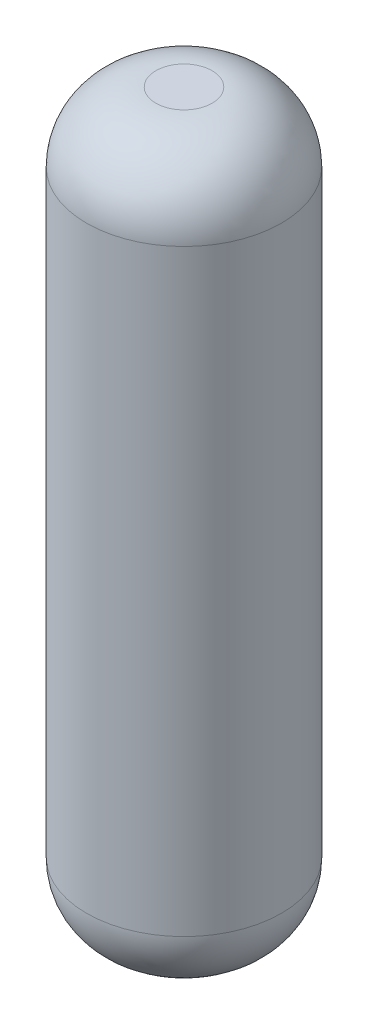
ISO-10303-21;
HEADER;
FILE_DESCRIPTION(('STEP AP214'),'2;1');
FILE_NAME('part.step','',(''),(''),'','','');
FILE_SCHEMA(('AUTOMOTIVE_DESIGN { 1 0 10303 214 1 1 1 1 }'));
ENDSEC;
DATA;
#1=APPLICATION_CONTEXT('core data for automotive mechanical design processes');
#2=APPLICATION_PROTOCOL_DEFINITION('international standard','automotive_design',2000,#1);
#3=PRODUCT_CONTEXT('',#1,'mechanical');
#4=PRODUCT('Part','Part','',(#3));
#5=PRODUCT_RELATED_PRODUCT_CATEGORY('part','',(#4));
#6=PRODUCT_DEFINITION_FORMATION('','',#4);
#7=PRODUCT_DEFINITION_CONTEXT('part definition',#1,'design');
#8=PRODUCT_DEFINITION('design','',#6,#7);
#9=PRODUCT_DEFINITION_SHAPE('','',#8);
#10=(LENGTH_UNIT() NAMED_UNIT(*) SI_UNIT(.MILLI.,.METRE.));
#11=(NAMED_UNIT(*) PLANE_ANGLE_UNIT() SI_UNIT($,.RADIAN.));
#12=(NAMED_UNIT(*) SI_UNIT($,.STERADIAN.) SOLID_ANGLE_UNIT());
#13=UNCERTAINTY_MEASURE_WITH_UNIT(LENGTH_MEASURE(1.E-05),#10,'distance_accuracy_value','');
#14=(GEOMETRIC_REPRESENTATION_CONTEXT(3) GLOBAL_UNCERTAINTY_ASSIGNED_CONTEXT((#13)) GLOBAL_UNIT_ASSIGNED_CONTEXT((#10,
#11,#12)) REPRESENTATION_CONTEXT('',''));
#15=CARTESIAN_POINT('',(0.,0.,0.));
#16=DIRECTION('',(0.,0.,1.));
#17=DIRECTION('',(1.,0.,0.));
#18=AXIS2_PLACEMENT_3D('',#15,#16,#17);
#19=CARTESIAN_POINT('',(0.,431.8,0.));
#20=DIRECTION('',(0.,-1.,0.));
#21=DIRECTION('',(0.,0.,-1.));
#22=AXIS2_PLACEMENT_3D('',#19,#20,#21);
#23=CYLINDRICAL_SURFACE('',#22,57.15);
#24=CARTESIAN_POINT('',(0.,40.64,0.));
#25=DIRECTION('',(0.,1.,0.));
#26=DIRECTION('',(0.,0.,1.));
#27=AXIS2_PLACEMENT_3D('',#24,#25,#26);
#28=CIRCLE('',#27,57.15);
#29=CARTESIAN_POINT('',(0.,40.64,57.15));
#30=VERTEX_POINT('',#29);
#31=EDGE_CURVE('E50',#30,#30,#28,.T.);
#32=ORIENTED_EDGE('',*,*,#31,.T.);
#33=EDGE_LOOP('',(#32));
#34=FACE_BOUND('',#33,.T.);
#35=CARTESIAN_POINT('',(0.,391.16,0.));
#36=DIRECTION('',(0.,1.,0.));
#37=DIRECTION('',(0.,0.,1.));
#38=AXIS2_PLACEMENT_3D('',#35,#36,#37);
#39=CIRCLE('',#38,57.15);
#40=CARTESIAN_POINT('',(0.,391.16,57.15));
#41=VERTEX_POINT('',#40);
#42=EDGE_CURVE('E55',#41,#41,#39,.F.);
#43=ORIENTED_EDGE('',*,*,#42,.T.);
#44=EDGE_LOOP('',(#43));
#45=FACE_BOUND('',#44,.T.);
#46=ADVANCED_FACE('F37',(#34,#45),#23,.T.);
#47=CARTESIAN_POINT('',(0.,431.8,0.));
#48=DIRECTION('',(0.,1.,0.));
#49=DIRECTION('',(0.,0.,1.));
#50=AXIS2_PLACEMENT_3D('',#47,#48,#49);
#51=PLANE('',#50);
#52=CARTESIAN_POINT('',(0.,431.8,0.));
#53=DIRECTION('',(0.,1.,0.));
#54=DIRECTION('',(0.,0.,1.));
#55=AXIS2_PLACEMENT_3D('',#52,#53,#54);
#56=CIRCLE('',#55,16.51);
#57=CARTESIAN_POINT('',(0.,431.8,16.51));
#58=VERTEX_POINT('',#57);
#59=EDGE_CURVE('E10',#58,#58,#56,.T.);
#60=ORIENTED_EDGE('',*,*,#59,.T.);
#61=EDGE_LOOP('',(#60));
#62=FACE_BOUND('',#61,.T.);
#63=ADVANCED_FACE('F72',(#62),#51,.T.);
#64=CARTESIAN_POINT('',(0.,0.,0.));
#65=DIRECTION('',(0.,1.,0.));
#66=DIRECTION('',(0.,0.,1.));
#67=AXIS2_PLACEMENT_3D('',#64,#65,#66);
#68=PLANE('',#67);
#69=CARTESIAN_POINT('',(0.,0.,0.));
#70=DIRECTION('',(0.,1.,0.));
#71=DIRECTION('',(0.,0.,1.));
#72=AXIS2_PLACEMENT_3D('',#69,#70,#71);
#73=CIRCLE('',#72,16.51);
#74=CARTESIAN_POINT('',(0.,0.,16.51));
#75=VERTEX_POINT('',#74);
#76=EDGE_CURVE('E45',#75,#75,#73,.F.);
#77=ORIENTED_EDGE('',*,*,#76,.T.);
#78=EDGE_LOOP('',(#77));
#79=FACE_BOUND('',#78,.T.);
#80=ADVANCED_FACE('F69',(#79),#68,.F.);
#81=CARTESIAN_POINT('',(0.,40.64,0.));
#82=DIRECTION('',(0.,1.,0.));
#83=DIRECTION('',(0.,0.,1.));
#84=AXIS2_PLACEMENT_3D('',#81,#82,#83);
#85=DEGENERATE_TOROIDAL_SURFACE('',#84,16.51,40.64,.T.);
#86=ORIENTED_EDGE('',*,*,#76,.F.);
#87=EDGE_LOOP('',(#86));
#88=FACE_BOUND('',#87,.T.);
#89=ORIENTED_EDGE('',*,*,#31,.F.);
#90=EDGE_LOOP('',(#89));
#91=FACE_BOUND('',#90,.T.);
#92=ADVANCED_FACE('F65',(#88,#91),#85,.T.);
#93=CARTESIAN_POINT('',(0.,391.16,0.));
#94=DIRECTION('',(0.,1.,0.));
#95=DIRECTION('',(0.,0.,1.));
#96=AXIS2_PLACEMENT_3D('',#93,#94,#95);
#97=DEGENERATE_TOROIDAL_SURFACE('',#96,16.51,40.64,.T.);
#98=ORIENTED_EDGE('',*,*,#42,.F.);
#99=EDGE_LOOP('',(#98));
#100=FACE_BOUND('',#99,.T.);
#101=ORIENTED_EDGE('',*,*,#59,.F.);
#102=EDGE_LOOP('',(#101));
#103=FACE_BOUND('',#102,.T.);
#104=ADVANCED_FACE('F39',(#100,#103),#97,.T.);
#105=CLOSED_SHELL('',(#46,#63,#80,#92,#104));
#106=MANIFOLD_SOLID_BREP('B2',#105);
#107=ADVANCED_BREP_SHAPE_REPRESENTATION('',(#18,#106),#14);
#108=SHAPE_DEFINITION_REPRESENTATION(#9,#107);
ENDSEC;
END-ISO-10303-21;
